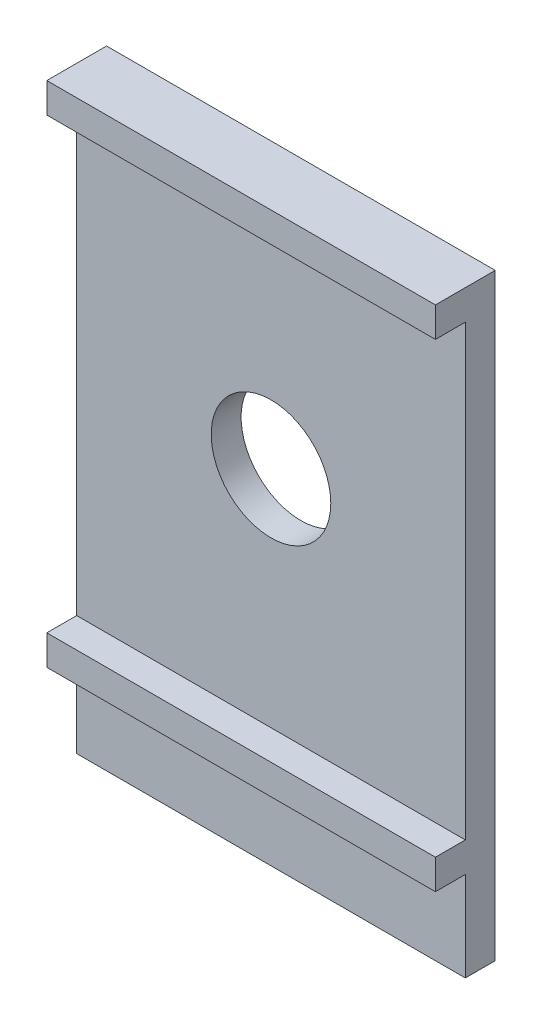
ISO-10303-21;
HEADER;
FILE_DESCRIPTION(('STEP AP214'),'2;1');
FILE_NAME('part.step','',(''),(''),'','','');
FILE_SCHEMA(('AUTOMOTIVE_DESIGN { 1 0 10303 214 1 1 1 1 }'));
ENDSEC;
DATA;
#1=APPLICATION_CONTEXT('core data for automotive mechanical design processes');
#2=APPLICATION_PROTOCOL_DEFINITION('international standard','automotive_design',2000,#1);
#3=PRODUCT_CONTEXT('',#1,'mechanical');
#4=PRODUCT('Part','Part','',(#3));
#5=PRODUCT_RELATED_PRODUCT_CATEGORY('part','',(#4));
#6=PRODUCT_DEFINITION_FORMATION('','',#4);
#7=PRODUCT_DEFINITION_CONTEXT('part definition',#1,'design');
#8=PRODUCT_DEFINITION('design','',#6,#7);
#9=PRODUCT_DEFINITION_SHAPE('','',#8);
#10=(LENGTH_UNIT() NAMED_UNIT(*) SI_UNIT(.MILLI.,.METRE.));
#11=(NAMED_UNIT(*) PLANE_ANGLE_UNIT() SI_UNIT($,.RADIAN.));
#12=(NAMED_UNIT(*) SI_UNIT($,.STERADIAN.) SOLID_ANGLE_UNIT());
#13=UNCERTAINTY_MEASURE_WITH_UNIT(LENGTH_MEASURE(1.E-05),#10,'distance_accuracy_value','');
#14=(GEOMETRIC_REPRESENTATION_CONTEXT(3) GLOBAL_UNCERTAINTY_ASSIGNED_CONTEXT((#13)) GLOBAL_UNIT_ASSIGNED_CONTEXT((#10,
#11,#12)) REPRESENTATION_CONTEXT('',''));
#15=CARTESIAN_POINT('',(0.,0.,0.));
#16=DIRECTION('',(0.,0.,1.));
#17=DIRECTION('',(1.,0.,0.));
#18=AXIS2_PLACEMENT_3D('',#15,#16,#17);
#19=CARTESIAN_POINT('',(0.,0.,1.));
#20=DIRECTION('',(0.,0.,-1.));
#21=DIRECTION('',(-1.,0.,0.));
#22=AXIS2_PLACEMENT_3D('',#19,#20,#21);
#23=PLANE('',#22);
#24=DIRECTION('',(0.,-1.,0.));
#25=VECTOR('',#24,1.);
#26=CARTESIAN_POINT('',(0.,0.,1.));
#27=LINE('',#26,#25);
#28=CARTESIAN_POINT('',(0.,6.5,1.));
#29=VERTEX_POINT('',#28);
#30=CARTESIAN_POINT('',(0.,3.5,1.));
#31=VERTEX_POINT('',#30);
#32=EDGE_CURVE('E117',#29,#31,#27,.T.);
#33=ORIENTED_EDGE('',*,*,#32,.T.);
#34=DIRECTION('',(-1.,0.,0.));
#35=VECTOR('',#34,1.);
#36=CARTESIAN_POINT('',(0.,3.5,1.));
#37=LINE('',#36,#35);
#38=CARTESIAN_POINT('',(13.,3.5,1.));
#39=VERTEX_POINT('',#38);
#40=EDGE_CURVE('E111',#39,#31,#37,.T.);
#41=ORIENTED_EDGE('',*,*,#40,.F.);
#42=DIRECTION('',(0.,1.,0.));
#43=VECTOR('',#42,1.);
#44=CARTESIAN_POINT('',(13.,0.,1.));
#45=LINE('',#44,#43);
#46=CARTESIAN_POINT('',(13.,6.5,1.));
#47=VERTEX_POINT('',#46);
#48=EDGE_CURVE('E116',#39,#47,#45,.T.);
#49=ORIENTED_EDGE('',*,*,#48,.T.);
#50=DIRECTION('',(1.,0.,0.));
#51=VECTOR('',#50,1.);
#52=CARTESIAN_POINT('',(0.,6.5,1.));
#53=LINE('',#52,#51);
#54=EDGE_CURVE('E55',#29,#47,#53,.T.);
#55=ORIENTED_EDGE('',*,*,#54,.F.);
#56=EDGE_LOOP('',(#33,#41,#49,#55));
#57=FACE_BOUND('',#56,.T.);
#58=ADVANCED_FACE('F33',(#57),#23,.F.);
#59=CARTESIAN_POINT('',(6.5,15.,1.));
#60=DIRECTION('',(0.,0.,1.));
#61=DIRECTION('',(1.,0.,0.));
#62=AXIS2_PLACEMENT_3D('',#59,#60,#61);
#63=CIRCLE('',#62,2.);
#64=CARTESIAN_POINT('',(8.5,15.,1.));
#65=VERTEX_POINT('',#64);
#66=EDGE_CURVE('E212',#65,#65,#63,.T.);
#67=ORIENTED_EDGE('',*,*,#66,.F.);
#68=EDGE_LOOP('',(#67));
#69=FACE_BOUND('',#68,.T.);
#70=DIRECTION('',(-1.,0.,0.));
#71=VECTOR('',#70,1.);
#72=CARTESIAN_POINT('',(0.,7.5,1.));
#73=LINE('',#72,#71);
#74=CARTESIAN_POINT('',(13.,7.5,1.));
#75=VERTEX_POINT('',#74);
#76=CARTESIAN_POINT('',(0.,7.5,1.));
#77=VERTEX_POINT('',#76);
#78=EDGE_CURVE('E185',#75,#77,#73,.T.);
#79=ORIENTED_EDGE('',*,*,#78,.F.);
#80=CARTESIAN_POINT('',(13.,22.5,1.));
#81=VERTEX_POINT('',#80);
#82=EDGE_CURVE('E125',#75,#81,#45,.T.);
#83=ORIENTED_EDGE('',*,*,#82,.T.);
#84=DIRECTION('',(1.,0.,0.));
#85=VECTOR('',#84,1.);
#86=CARTESIAN_POINT('',(0.,22.5,1.));
#87=LINE('',#86,#85);
#88=CARTESIAN_POINT('',(0.,22.5,1.));
#89=VERTEX_POINT('',#88);
#90=EDGE_CURVE('E169',#89,#81,#87,.T.);
#91=ORIENTED_EDGE('',*,*,#90,.F.);
#92=EDGE_CURVE('E129',#89,#77,#27,.T.);
#93=ORIENTED_EDGE('',*,*,#92,.T.);
#94=EDGE_LOOP('',(#79,#83,#91,#93));
#95=FACE_BOUND('',#94,.T.);
#96=ADVANCED_FACE('F184',(#69,#95),#23,.F.);
#97=CARTESIAN_POINT('',(0.,0.,1.));
#98=DIRECTION('',(1.,0.,0.));
#99=DIRECTION('',(0.,1.,0.));
#100=AXIS2_PLACEMENT_3D('',#97,#98,#99);
#101=PLANE('',#100);
#102=DIRECTION('',(0.,-1.,0.));
#103=VECTOR('',#102,1.);
#104=CARTESIAN_POINT('',(0.,0.,0.));
#105=LINE('',#104,#103);
#106=CARTESIAN_POINT('',(0.,23.5,0.));
#107=VERTEX_POINT('',#106);
#108=CARTESIAN_POINT('',(0.,3.5,0.));
#109=VERTEX_POINT('',#108);
#110=EDGE_CURVE('E133',#107,#109,#105,.T.);
#111=ORIENTED_EDGE('',*,*,#110,.T.);
#112=DIRECTION('',(0.,0.,1.));
#113=VECTOR('',#112,1.);
#114=CARTESIAN_POINT('',(0.,3.5,-9.));
#115=LINE('',#114,#113);
#116=EDGE_CURVE('E47',#109,#31,#115,.T.);
#117=ORIENTED_EDGE('',*,*,#116,.T.);
#118=ORIENTED_EDGE('',*,*,#32,.F.);
#119=DIRECTION('',(0.,0.,-1.));
#120=VECTOR('',#119,1.);
#121=CARTESIAN_POINT('',(0.,6.5,2.));
#122=LINE('',#121,#120);
#123=CARTESIAN_POINT('',(0.,6.5,2.));
#124=VERTEX_POINT('',#123);
#125=EDGE_CURVE('E171',#124,#29,#122,.T.);
#126=ORIENTED_EDGE('',*,*,#125,.F.);
#127=DIRECTION('',(0.,-1.,0.));
#128=VECTOR('',#127,1.);
#129=CARTESIAN_POINT('',(0.,7.5,2.));
#130=LINE('',#129,#128);
#131=CARTESIAN_POINT('',(0.,7.5,2.));
#132=VERTEX_POINT('',#131);
#133=EDGE_CURVE('E192',#132,#124,#130,.T.);
#134=ORIENTED_EDGE('',*,*,#133,.F.);
#135=DIRECTION('',(0.,0.,-1.));
#136=VECTOR('',#135,1.);
#137=CARTESIAN_POINT('',(0.,7.5,2.));
#138=LINE('',#137,#136);
#139=EDGE_CURVE('E180',#132,#77,#138,.T.);
#140=ORIENTED_EDGE('',*,*,#139,.T.);
#141=ORIENTED_EDGE('',*,*,#92,.F.);
#142=DIRECTION('',(0.,0.,-1.));
#143=VECTOR('',#142,1.);
#144=CARTESIAN_POINT('',(0.,22.5,2.));
#145=LINE('',#144,#143);
#146=CARTESIAN_POINT('',(0.,22.5,2.));
#147=VERTEX_POINT('',#146);
#148=EDGE_CURVE('E137',#147,#89,#145,.T.);
#149=ORIENTED_EDGE('',*,*,#148,.F.);
#150=DIRECTION('',(0.,-1.,0.));
#151=VECTOR('',#150,1.);
#152=CARTESIAN_POINT('',(0.,23.5,2.));
#153=LINE('',#152,#151);
#154=CARTESIAN_POINT('',(0.,23.5,2.));
#155=VERTEX_POINT('',#154);
#156=EDGE_CURVE('E157',#155,#147,#153,.T.);
#157=ORIENTED_EDGE('',*,*,#156,.F.);
#158=DIRECTION('',(0.,0.,-1.));
#159=VECTOR('',#158,1.);
#160=CARTESIAN_POINT('',(0.,23.5,1.));
#161=LINE('',#160,#159);
#162=EDGE_CURVE('E124',#155,#107,#161,.T.);
#163=ORIENTED_EDGE('',*,*,#162,.T.);
#164=EDGE_LOOP('',(#111,#117,#118,#126,#134,#140,#141,#149,#157,#163));
#165=FACE_BOUND('',#164,.T.);
#166=ADVANCED_FACE('F35',(#165),#101,.F.);
#167=CARTESIAN_POINT('',(13.,0.,1.));
#168=DIRECTION('',(-1.,0.,0.));
#169=DIRECTION('',(0.,-1.,0.));
#170=AXIS2_PLACEMENT_3D('',#167,#168,#169);
#171=PLANE('',#170);
#172=ORIENTED_EDGE('',*,*,#48,.F.);
#173=DIRECTION('',(0.,0.,1.));
#174=VECTOR('',#173,1.);
#175=CARTESIAN_POINT('',(13.,3.5,-9.));
#176=LINE('',#175,#174);
#177=CARTESIAN_POINT('',(13.,3.5,0.));
#178=VERTEX_POINT('',#177);
#179=EDGE_CURVE('E108',#178,#39,#176,.T.);
#180=ORIENTED_EDGE('',*,*,#179,.F.);
#181=DIRECTION('',(0.,1.,0.));
#182=VECTOR('',#181,1.);
#183=CARTESIAN_POINT('',(13.,0.,0.));
#184=LINE('',#183,#182);
#185=CARTESIAN_POINT('',(13.,23.5,0.));
#186=VERTEX_POINT('',#185);
#187=EDGE_CURVE('E136',#178,#186,#184,.T.);
#188=ORIENTED_EDGE('',*,*,#187,.T.);
#189=DIRECTION('',(0.,0.,-1.));
#190=VECTOR('',#189,1.);
#191=CARTESIAN_POINT('',(13.,23.5,1.));
#192=LINE('',#191,#190);
#193=CARTESIAN_POINT('',(13.,23.5,2.));
#194=VERTEX_POINT('',#193);
#195=EDGE_CURVE('E41',#194,#186,#192,.T.);
#196=ORIENTED_EDGE('',*,*,#195,.F.);
#197=DIRECTION('',(0.,1.,0.));
#198=VECTOR('',#197,1.);
#199=CARTESIAN_POINT('',(13.,23.5,2.));
#200=LINE('',#199,#198);
#201=CARTESIAN_POINT('',(13.,22.5,2.));
#202=VERTEX_POINT('',#201);
#203=EDGE_CURVE('E160',#202,#194,#200,.T.);
#204=ORIENTED_EDGE('',*,*,#203,.F.);
#205=DIRECTION('',(0.,0.,-1.));
#206=VECTOR('',#205,1.);
#207=CARTESIAN_POINT('',(13.,22.5,2.));
#208=LINE('',#207,#206);
#209=EDGE_CURVE('E161',#202,#81,#208,.T.);
#210=ORIENTED_EDGE('',*,*,#209,.T.);
#211=ORIENTED_EDGE('',*,*,#82,.F.);
#212=DIRECTION('',(0.,0.,-1.));
#213=VECTOR('',#212,1.);
#214=CARTESIAN_POINT('',(13.,7.5,2.));
#215=LINE('',#214,#213);
#216=CARTESIAN_POINT('',(13.,7.5,2.));
#217=VERTEX_POINT('',#216);
#218=EDGE_CURVE('E191',#217,#75,#215,.T.);
#219=ORIENTED_EDGE('',*,*,#218,.F.);
#220=DIRECTION('',(0.,1.,0.));
#221=VECTOR('',#220,1.);
#222=CARTESIAN_POINT('',(13.,7.5,2.));
#223=LINE('',#222,#221);
#224=CARTESIAN_POINT('',(13.,6.5,2.));
#225=VERTEX_POINT('',#224);
#226=EDGE_CURVE('E207',#225,#217,#223,.T.);
#227=ORIENTED_EDGE('',*,*,#226,.F.);
#228=DIRECTION('',(0.,0.,-1.));
#229=VECTOR('',#228,1.);
#230=CARTESIAN_POINT('',(13.,6.5,2.));
#231=LINE('',#230,#229);
#232=EDGE_CURVE('E123',#225,#47,#231,.T.);
#233=ORIENTED_EDGE('',*,*,#232,.T.);
#234=EDGE_LOOP('',(#172,#180,#188,#196,#204,#210,#211,#219,#227,#233));
#235=FACE_BOUND('',#234,.T.);
#236=ADVANCED_FACE('F120',(#235),#171,.F.);
#237=CARTESIAN_POINT('',(0.,23.5,1.));
#238=DIRECTION('',(0.,-1.,0.));
#239=DIRECTION('',(0.,0.,-1.));
#240=AXIS2_PLACEMENT_3D('',#237,#238,#239);
#241=PLANE('',#240);
#242=DIRECTION('',(-1.,0.,0.));
#243=VECTOR('',#242,1.);
#244=CARTESIAN_POINT('',(0.,23.5,0.));
#245=LINE('',#244,#243);
#246=EDGE_CURVE('E139',#186,#107,#245,.T.);
#247=ORIENTED_EDGE('',*,*,#246,.T.);
#248=ORIENTED_EDGE('',*,*,#162,.F.);
#249=DIRECTION('',(-1.,0.,0.));
#250=VECTOR('',#249,1.);
#251=CARTESIAN_POINT('',(0.,23.5,2.));
#252=LINE('',#251,#250);
#253=EDGE_CURVE('E146',#194,#155,#252,.T.);
#254=ORIENTED_EDGE('',*,*,#253,.F.);
#255=ORIENTED_EDGE('',*,*,#195,.T.);
#256=EDGE_LOOP('',(#247,#248,#254,#255));
#257=FACE_BOUND('',#256,.T.);
#258=ADVANCED_FACE('F144',(#257),#241,.F.);
#259=CARTESIAN_POINT('',(0.,0.,0.));
#260=DIRECTION('',(0.,0.,-1.));
#261=DIRECTION('',(-1.,0.,0.));
#262=AXIS2_PLACEMENT_3D('',#259,#260,#261);
#263=PLANE('',#262);
#264=DIRECTION('',(1.,0.,0.));
#265=VECTOR('',#264,1.);
#266=CARTESIAN_POINT('',(0.,3.5,0.));
#267=LINE('',#266,#265);
#268=EDGE_CURVE('E11',#109,#178,#267,.T.);
#269=ORIENTED_EDGE('',*,*,#268,.F.);
#270=ORIENTED_EDGE('',*,*,#110,.F.);
#271=ORIENTED_EDGE('',*,*,#246,.F.);
#272=ORIENTED_EDGE('',*,*,#187,.F.);
#273=EDGE_LOOP('',(#269,#270,#271,#272));
#274=FACE_BOUND('',#273,.T.);
#275=CARTESIAN_POINT('',(6.5,15.,0.));
#276=DIRECTION('',(0.,0.,1.));
#277=DIRECTION('',(1.,0.,0.));
#278=AXIS2_PLACEMENT_3D('',#275,#276,#277);
#279=CIRCLE('',#278,2.);
#280=CARTESIAN_POINT('',(8.5,15.,0.));
#281=VERTEX_POINT('',#280);
#282=EDGE_CURVE('E197',#281,#281,#279,.T.);
#283=ORIENTED_EDGE('',*,*,#282,.T.);
#284=EDGE_LOOP('',(#283));
#285=FACE_BOUND('',#284,.T.);
#286=ADVANCED_FACE('F151',(#274,#285),#263,.T.);
#287=CARTESIAN_POINT('',(0.,22.5,2.));
#288=DIRECTION('',(0.,1.,0.));
#289=DIRECTION('',(0.,0.,1.));
#290=AXIS2_PLACEMENT_3D('',#287,#288,#289);
#291=PLANE('',#290);
#292=ORIENTED_EDGE('',*,*,#90,.T.);
#293=ORIENTED_EDGE('',*,*,#209,.F.);
#294=DIRECTION('',(1.,0.,0.));
#295=VECTOR('',#294,1.);
#296=CARTESIAN_POINT('',(0.,22.5,2.));
#297=LINE('',#296,#295);
#298=EDGE_CURVE('E165',#147,#202,#297,.T.);
#299=ORIENTED_EDGE('',*,*,#298,.F.);
#300=ORIENTED_EDGE('',*,*,#148,.T.);
#301=EDGE_LOOP('',(#292,#293,#299,#300));
#302=FACE_BOUND('',#301,.T.);
#303=ADVANCED_FACE('F174',(#302),#291,.F.);
#304=CARTESIAN_POINT('',(0.,0.,2.));
#305=DIRECTION('',(0.,0.,1.));
#306=DIRECTION('',(1.,0.,0.));
#307=AXIS2_PLACEMENT_3D('',#304,#305,#306);
#308=PLANE('',#307);
#309=ORIENTED_EDGE('',*,*,#156,.T.);
#310=ORIENTED_EDGE('',*,*,#298,.T.);
#311=ORIENTED_EDGE('',*,*,#203,.T.);
#312=ORIENTED_EDGE('',*,*,#253,.T.);
#313=EDGE_LOOP('',(#309,#310,#311,#312));
#314=FACE_BOUND('',#313,.T.);
#315=ADVANCED_FACE('F159',(#314),#308,.T.);
#316=CARTESIAN_POINT('',(0.,6.5,2.));
#317=DIRECTION('',(0.,1.,0.));
#318=DIRECTION('',(0.,0.,1.));
#319=AXIS2_PLACEMENT_3D('',#316,#317,#318);
#320=PLANE('',#319);
#321=ORIENTED_EDGE('',*,*,#54,.T.);
#322=ORIENTED_EDGE('',*,*,#232,.F.);
#323=DIRECTION('',(1.,0.,0.));
#324=VECTOR('',#323,1.);
#325=CARTESIAN_POINT('',(0.,6.5,2.));
#326=LINE('',#325,#324);
#327=EDGE_CURVE('E195',#124,#225,#326,.T.);
#328=ORIENTED_EDGE('',*,*,#327,.F.);
#329=ORIENTED_EDGE('',*,*,#125,.T.);
#330=EDGE_LOOP('',(#321,#322,#328,#329));
#331=FACE_BOUND('',#330,.T.);
#332=ADVANCED_FACE('F273',(#331),#320,.F.);
#333=CARTESIAN_POINT('',(0.,7.5,2.));
#334=DIRECTION('',(0.,-1.,0.));
#335=DIRECTION('',(0.,0.,-1.));
#336=AXIS2_PLACEMENT_3D('',#333,#334,#335);
#337=PLANE('',#336);
#338=ORIENTED_EDGE('',*,*,#78,.T.);
#339=ORIENTED_EDGE('',*,*,#139,.F.);
#340=DIRECTION('',(-1.,0.,0.));
#341=VECTOR('',#340,1.);
#342=CARTESIAN_POINT('',(0.,7.5,2.));
#343=LINE('',#342,#341);
#344=EDGE_CURVE('E202',#217,#132,#343,.T.);
#345=ORIENTED_EDGE('',*,*,#344,.F.);
#346=ORIENTED_EDGE('',*,*,#218,.T.);
#347=EDGE_LOOP('',(#338,#339,#345,#346));
#348=FACE_BOUND('',#347,.T.);
#349=ADVANCED_FACE('F188',(#348),#337,.F.);
#350=CARTESIAN_POINT('',(0.,0.,2.));
#351=DIRECTION('',(0.,0.,1.));
#352=DIRECTION('',(1.,0.,0.));
#353=AXIS2_PLACEMENT_3D('',#350,#351,#352);
#354=PLANE('',#353);
#355=ORIENTED_EDGE('',*,*,#133,.T.);
#356=ORIENTED_EDGE('',*,*,#327,.T.);
#357=ORIENTED_EDGE('',*,*,#226,.T.);
#358=ORIENTED_EDGE('',*,*,#344,.T.);
#359=EDGE_LOOP('',(#355,#356,#357,#358));
#360=FACE_BOUND('',#359,.T.);
#361=ADVANCED_FACE('F222',(#360),#354,.T.);
#362=CARTESIAN_POINT('',(6.5,15.,0.));
#363=DIRECTION('',(0.,0.,1.));
#364=DIRECTION('',(1.,0.,0.));
#365=AXIS2_PLACEMENT_3D('',#362,#363,#364);
#366=CYLINDRICAL_SURFACE('',#365,2.);
#367=ORIENTED_EDGE('',*,*,#282,.F.);
#368=EDGE_LOOP('',(#367));
#369=FACE_BOUND('',#368,.T.);
#370=ORIENTED_EDGE('',*,*,#66,.T.);
#371=EDGE_LOOP('',(#370));
#372=FACE_BOUND('',#371,.T.);
#373=ADVANCED_FACE('F219',(#369,#372),#366,.F.);
#374=CARTESIAN_POINT('',(0.,3.5,-9.));
#375=DIRECTION('',(0.,1.,0.));
#376=DIRECTION('',(0.,0.,1.));
#377=AXIS2_PLACEMENT_3D('',#374,#375,#376);
#378=PLANE('',#377);
#379=ORIENTED_EDGE('',*,*,#268,.T.);
#380=ORIENTED_EDGE('',*,*,#179,.T.);
#381=ORIENTED_EDGE('',*,*,#40,.T.);
#382=ORIENTED_EDGE('',*,*,#116,.F.);
#383=EDGE_LOOP('',(#379,#380,#381,#382));
#384=FACE_BOUND('',#383,.T.);
#385=ADVANCED_FACE('F110',(#384),#378,.F.);
#386=CLOSED_SHELL('',(#58,#96,#166,#236,#258,#286,#303,#315,#332,#349,#361,#373,#385));
#387=MANIFOLD_SOLID_BREP('B2',#386);
#388=ADVANCED_BREP_SHAPE_REPRESENTATION('',(#18,#387),#14);
#389=SHAPE_DEFINITION_REPRESENTATION(#9,#388);
ENDSEC;
END-ISO-10303-21;
